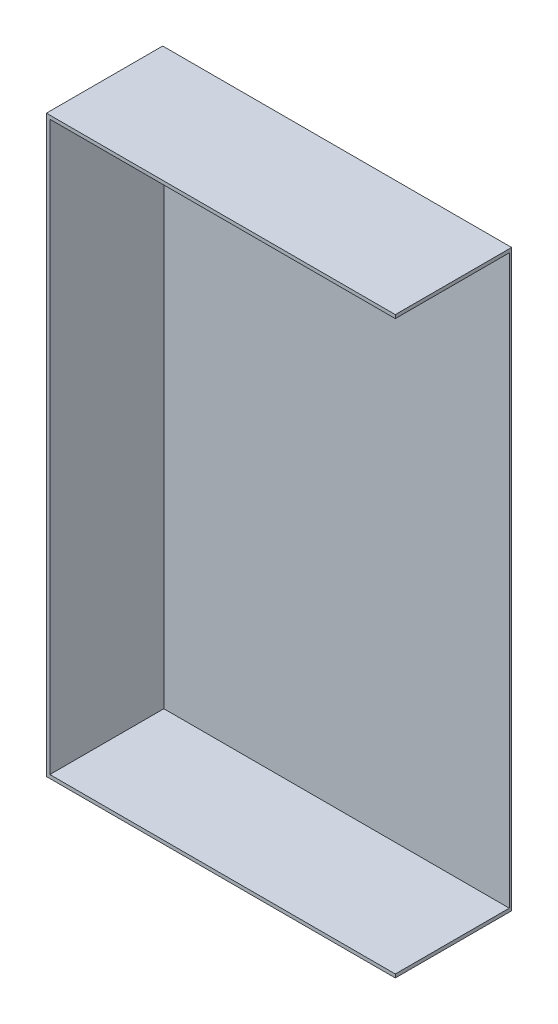
ISO-10303-21;
HEADER;
FILE_DESCRIPTION(('STEP AP214'),'2;1');
FILE_NAME('part.step','',(''),(''),'','','');
FILE_SCHEMA(('AUTOMOTIVE_DESIGN { 1 0 10303 214 1 1 1 1 }'));
ENDSEC;
DATA;
#1=APPLICATION_CONTEXT('core data for automotive mechanical design processes');
#2=APPLICATION_PROTOCOL_DEFINITION('international standard','automotive_design',2000,#1);
#3=PRODUCT_CONTEXT('',#1,'mechanical');
#4=PRODUCT('Part','Part','',(#3));
#5=PRODUCT_RELATED_PRODUCT_CATEGORY('part','',(#4));
#6=PRODUCT_DEFINITION_FORMATION('','',#4);
#7=PRODUCT_DEFINITION_CONTEXT('part definition',#1,'design');
#8=PRODUCT_DEFINITION('design','',#6,#7);
#9=PRODUCT_DEFINITION_SHAPE('','',#8);
#10=(LENGTH_UNIT() NAMED_UNIT(*) SI_UNIT(.MILLI.,.METRE.));
#11=(NAMED_UNIT(*) PLANE_ANGLE_UNIT() SI_UNIT($,.RADIAN.));
#12=(NAMED_UNIT(*) SI_UNIT($,.STERADIAN.) SOLID_ANGLE_UNIT());
#13=UNCERTAINTY_MEASURE_WITH_UNIT(LENGTH_MEASURE(1.E-05),#10,'distance_accuracy_value','');
#14=(GEOMETRIC_REPRESENTATION_CONTEXT(3) GLOBAL_UNCERTAINTY_ASSIGNED_CONTEXT((#13)) GLOBAL_UNIT_ASSIGNED_CONTEXT((#10,
#11,#12)) REPRESENTATION_CONTEXT('',''));
#15=CARTESIAN_POINT('',(0.,0.,0.));
#16=DIRECTION('',(0.,0.,1.));
#17=DIRECTION('',(1.,0.,0.));
#18=AXIS2_PLACEMENT_3D('',#15,#16,#17);
#19=CARTESIAN_POINT('',(0.,0.,127.));
#20=DIRECTION('',(1.,0.,0.));
#21=DIRECTION('',(0.,0.,-1.));
#22=AXIS2_PLACEMENT_3D('',#19,#20,#21);
#23=PLANE('',#22);
#24=DIRECTION('',(0.,-1.,0.));
#25=VECTOR('',#24,1.);
#26=CARTESIAN_POINT('',(0.,0.,0.));
#27=LINE('',#26,#25);
#28=CARTESIAN_POINT('',(0.,627.38,0.));
#29=VERTEX_POINT('',#28);
#30=CARTESIAN_POINT('',(0.,0.,0.));
#31=VERTEX_POINT('',#30);
#32=EDGE_CURVE('E149',#29,#31,#27,.T.);
#33=ORIENTED_EDGE('',*,*,#32,.T.);
#34=DIRECTION('',(0.,0.,-1.));
#35=VECTOR('',#34,1.);
#36=CARTESIAN_POINT('',(0.,0.,127.));
#37=LINE('',#36,#35);
#38=CARTESIAN_POINT('',(0.,0.,127.));
#39=VERTEX_POINT('',#38);
#40=EDGE_CURVE('E12',#39,#31,#37,.T.);
#41=ORIENTED_EDGE('',*,*,#40,.F.);
#42=DIRECTION('',(0.,-1.,0.));
#43=VECTOR('',#42,1.);
#44=CARTESIAN_POINT('',(0.,0.,127.));
#45=LINE('',#44,#43);
#46=CARTESIAN_POINT('',(0.,627.38,127.));
#47=VERTEX_POINT('',#46);
#48=EDGE_CURVE('E150',#47,#39,#45,.T.);
#49=ORIENTED_EDGE('',*,*,#48,.F.);
#50=DIRECTION('',(0.,0.,-1.));
#51=VECTOR('',#50,1.);
#52=CARTESIAN_POINT('',(0.,627.38,127.));
#53=LINE('',#52,#51);
#54=EDGE_CURVE('E158',#47,#29,#53,.T.);
#55=ORIENTED_EDGE('',*,*,#54,.T.);
#56=EDGE_LOOP('',(#33,#41,#49,#55));
#57=FACE_BOUND('',#56,.T.);
#58=ADVANCED_FACE('F41',(#57),#23,.F.);
#59=CARTESIAN_POINT('',(0.,0.,127.));
#60=DIRECTION('',(0.,1.,0.));
#61=DIRECTION('',(0.,0.,1.));
#62=AXIS2_PLACEMENT_3D('',#59,#60,#61);
#63=PLANE('',#62);
#64=DIRECTION('',(1.,0.,0.));
#65=VECTOR('',#64,1.);
#66=CARTESIAN_POINT('',(0.,0.,0.));
#67=LINE('',#66,#65);
#68=CARTESIAN_POINT('',(381.,0.,0.));
#69=VERTEX_POINT('',#68);
#70=EDGE_CURVE('E161',#31,#69,#67,.T.);
#71=ORIENTED_EDGE('',*,*,#70,.T.);
#72=DIRECTION('',(0.,0.,-1.));
#73=VECTOR('',#72,1.);
#74=CARTESIAN_POINT('',(381.,0.,127.));
#75=LINE('',#74,#73);
#76=CARTESIAN_POINT('',(381.,0.,127.));
#77=VERTEX_POINT('',#76);
#78=EDGE_CURVE('E48',#77,#69,#75,.T.);
#79=ORIENTED_EDGE('',*,*,#78,.F.);
#80=DIRECTION('',(1.,0.,0.));
#81=VECTOR('',#80,1.);
#82=CARTESIAN_POINT('',(0.,0.,127.));
#83=LINE('',#82,#81);
#84=EDGE_CURVE('E92',#39,#77,#83,.T.);
#85=ORIENTED_EDGE('',*,*,#84,.F.);
#86=ORIENTED_EDGE('',*,*,#40,.T.);
#87=EDGE_LOOP('',(#71,#79,#85,#86));
#88=FACE_BOUND('',#87,.T.);
#89=ADVANCED_FACE('F193',(#88),#63,.F.);
#90=CARTESIAN_POINT('',(381.,0.,127.));
#91=DIRECTION('',(-1.,0.,0.));
#92=DIRECTION('',(0.,0.,1.));
#93=AXIS2_PLACEMENT_3D('',#90,#91,#92);
#94=PLANE('',#93);
#95=DIRECTION('',(0.,1.,0.));
#96=VECTOR('',#95,1.);
#97=CARTESIAN_POINT('',(381.,0.,127.));
#98=LINE('',#97,#96);
#99=CARTESIAN_POINT('',(381.,623.57,127.));
#100=VERTEX_POINT('',#99);
#101=CARTESIAN_POINT('',(381.,627.38,127.));
#102=VERTEX_POINT('',#101);
#103=EDGE_CURVE('E153',#100,#102,#98,.T.);
#104=ORIENTED_EDGE('',*,*,#103,.F.);
#105=DIRECTION('',(0.,0.,1.));
#106=VECTOR('',#105,1.);
#107=CARTESIAN_POINT('',(381.,623.57,-725.516887260386));
#108=LINE('',#107,#106);
#109=CARTESIAN_POINT('',(381.,623.57,2.53999999999999));
#110=VERTEX_POINT('',#109);
#111=EDGE_CURVE('E141',#110,#100,#108,.T.);
#112=ORIENTED_EDGE('',*,*,#111,.F.);
#113=DIRECTION('',(0.,1.,0.));
#114=VECTOR('',#113,1.);
#115=CARTESIAN_POINT('',(381.,623.57,2.53999999999999));
#116=LINE('',#115,#114);
#117=CARTESIAN_POINT('',(381.,3.81000000000002,2.53999999999999));
#118=VERTEX_POINT('',#117);
#119=EDGE_CURVE('E132',#118,#110,#116,.T.);
#120=ORIENTED_EDGE('',*,*,#119,.F.);
#121=DIRECTION('',(0.,0.,1.));
#122=VECTOR('',#121,1.);
#123=CARTESIAN_POINT('',(381.,3.81000000000002,-725.516887260386));
#124=LINE('',#123,#122);
#125=CARTESIAN_POINT('',(381.,3.81000000000002,127.));
#126=VERTEX_POINT('',#125);
#127=EDGE_CURVE('E142',#118,#126,#124,.T.);
#128=ORIENTED_EDGE('',*,*,#127,.T.);
#129=EDGE_CURVE('E154',#77,#126,#98,.T.);
#130=ORIENTED_EDGE('',*,*,#129,.F.);
#131=ORIENTED_EDGE('',*,*,#78,.T.);
#132=DIRECTION('',(0.,1.,0.));
#133=VECTOR('',#132,1.);
#134=CARTESIAN_POINT('',(381.,0.,0.));
#135=LINE('',#134,#133);
#136=CARTESIAN_POINT('',(381.,627.38,0.));
#137=VERTEX_POINT('',#136);
#138=EDGE_CURVE('E163',#69,#137,#135,.T.);
#139=ORIENTED_EDGE('',*,*,#138,.T.);
#140=DIRECTION('',(0.,0.,-1.));
#141=VECTOR('',#140,1.);
#142=CARTESIAN_POINT('',(381.,627.38,127.));
#143=LINE('',#142,#141);
#144=EDGE_CURVE('E167',#102,#137,#143,.T.);
#145=ORIENTED_EDGE('',*,*,#144,.F.);
#146=EDGE_LOOP('',(#104,#112,#120,#128,#130,#131,#139,#145));
#147=FACE_BOUND('',#146,.T.);
#148=ADVANCED_FACE('F173',(#147),#94,.F.);
#149=CARTESIAN_POINT('',(0.,627.38,127.));
#150=DIRECTION('',(0.,-1.,0.));
#151=DIRECTION('',(0.,0.,-1.));
#152=AXIS2_PLACEMENT_3D('',#149,#150,#151);
#153=PLANE('',#152);
#154=DIRECTION('',(-1.,0.,0.));
#155=VECTOR('',#154,1.);
#156=CARTESIAN_POINT('',(0.,627.38,0.));
#157=LINE('',#156,#155);
#158=EDGE_CURVE('E85',#137,#29,#157,.T.);
#159=ORIENTED_EDGE('',*,*,#158,.T.);
#160=ORIENTED_EDGE('',*,*,#54,.F.);
#161=DIRECTION('',(-1.,0.,0.));
#162=VECTOR('',#161,1.);
#163=CARTESIAN_POINT('',(0.,627.38,127.));
#164=LINE('',#163,#162);
#165=EDGE_CURVE('E64',#102,#47,#164,.T.);
#166=ORIENTED_EDGE('',*,*,#165,.F.);
#167=ORIENTED_EDGE('',*,*,#144,.T.);
#168=EDGE_LOOP('',(#159,#160,#166,#167));
#169=FACE_BOUND('',#168,.T.);
#170=ADVANCED_FACE('F181',(#169),#153,.F.);
#171=CARTESIAN_POINT('',(0.,0.,127.));
#172=DIRECTION('',(0.,0.,-1.));
#173=DIRECTION('',(-1.,0.,0.));
#174=AXIS2_PLACEMENT_3D('',#171,#172,#173);
#175=PLANE('',#174);
#176=DIRECTION('',(0.,-1.,0.));
#177=VECTOR('',#176,1.);
#178=CARTESIAN_POINT('',(3.80999999999998,623.57,127.));
#179=LINE('',#178,#177);
#180=CARTESIAN_POINT('',(3.80999999999998,623.57,127.));
#181=VERTEX_POINT('',#180);
#182=CARTESIAN_POINT('',(3.81000000000001,3.80999999999999,127.));
#183=VERTEX_POINT('',#182);
#184=EDGE_CURVE('E55',#181,#183,#179,.T.);
#185=ORIENTED_EDGE('',*,*,#184,.F.);
#186=DIRECTION('',(-1.,0.,0.));
#187=VECTOR('',#186,1.);
#188=CARTESIAN_POINT('',(381.,623.57,127.));
#189=LINE('',#188,#187);
#190=EDGE_CURVE('E128',#100,#181,#189,.T.);
#191=ORIENTED_EDGE('',*,*,#190,.F.);
#192=ORIENTED_EDGE('',*,*,#103,.T.);
#193=ORIENTED_EDGE('',*,*,#165,.T.);
#194=ORIENTED_EDGE('',*,*,#48,.T.);
#195=ORIENTED_EDGE('',*,*,#84,.T.);
#196=ORIENTED_EDGE('',*,*,#129,.T.);
#197=DIRECTION('',(1.,0.,0.));
#198=VECTOR('',#197,1.);
#199=CARTESIAN_POINT('',(381.,3.81000000000002,127.));
#200=LINE('',#199,#198);
#201=EDGE_CURVE('E134',#183,#126,#200,.T.);
#202=ORIENTED_EDGE('',*,*,#201,.F.);
#203=EDGE_LOOP('',(#185,#191,#192,#193,#194,#195,#196,#202));
#204=FACE_BOUND('',#203,.T.);
#205=ADVANCED_FACE('F182',(#204),#175,.F.);
#206=CARTESIAN_POINT('',(0.,0.,0.));
#207=DIRECTION('',(0.,0.,-1.));
#208=DIRECTION('',(-1.,0.,0.));
#209=AXIS2_PLACEMENT_3D('',#206,#207,#208);
#210=PLANE('',#209);
#211=ORIENTED_EDGE('',*,*,#32,.F.);
#212=ORIENTED_EDGE('',*,*,#158,.F.);
#213=ORIENTED_EDGE('',*,*,#138,.F.);
#214=ORIENTED_EDGE('',*,*,#70,.F.);
#215=EDGE_LOOP('',(#211,#212,#213,#214));
#216=FACE_BOUND('',#215,.T.);
#217=ADVANCED_FACE('F177',(#216),#210,.T.);
#218=CARTESIAN_POINT('',(0.,0.,2.54));
#219=DIRECTION('',(0.,0.,-1.));
#220=DIRECTION('',(-1.,0.,0.));
#221=AXIS2_PLACEMENT_3D('',#218,#219,#220);
#222=PLANE('',#221);
#223=ORIENTED_EDGE('',*,*,#119,.T.);
#224=DIRECTION('',(-1.,0.,0.));
#225=VECTOR('',#224,1.);
#226=CARTESIAN_POINT('',(381.,623.57,2.53999999999999));
#227=LINE('',#226,#225);
#228=CARTESIAN_POINT('',(3.80999999999998,623.57,2.53999999999999));
#229=VERTEX_POINT('',#228);
#230=EDGE_CURVE('E125',#110,#229,#227,.T.);
#231=ORIENTED_EDGE('',*,*,#230,.T.);
#232=DIRECTION('',(0.,-1.,0.));
#233=VECTOR('',#232,1.);
#234=CARTESIAN_POINT('',(3.80999999999998,623.57,2.53999999999999));
#235=LINE('',#234,#233);
#236=CARTESIAN_POINT('',(3.81000000000001,3.80999999999998,2.53999999999999));
#237=VERTEX_POINT('',#236);
#238=EDGE_CURVE('E113',#229,#237,#235,.T.);
#239=ORIENTED_EDGE('',*,*,#238,.T.);
#240=DIRECTION('',(1.,0.,0.));
#241=VECTOR('',#240,1.);
#242=CARTESIAN_POINT('',(381.,3.81000000000002,2.53999999999999));
#243=LINE('',#242,#241);
#244=EDGE_CURVE('E143',#237,#118,#243,.T.);
#245=ORIENTED_EDGE('',*,*,#244,.T.);
#246=EDGE_LOOP('',(#223,#231,#239,#245));
#247=FACE_BOUND('',#246,.T.);
#248=ADVANCED_FACE('F130',(#247),#222,.F.);
#249=CARTESIAN_POINT('',(381.,623.57,-725.516887260386));
#250=DIRECTION('',(0.,1.,0.));
#251=DIRECTION('',(0.,0.,1.));
#252=AXIS2_PLACEMENT_3D('',#249,#250,#251);
#253=PLANE('',#252);
#254=ORIENTED_EDGE('',*,*,#111,.T.);
#255=ORIENTED_EDGE('',*,*,#190,.T.);
#256=DIRECTION('',(0.,0.,1.));
#257=VECTOR('',#256,1.);
#258=CARTESIAN_POINT('',(3.80999999999998,623.57,-725.516887260386));
#259=LINE('',#258,#257);
#260=EDGE_CURVE('E116',#229,#181,#259,.T.);
#261=ORIENTED_EDGE('',*,*,#260,.F.);
#262=ORIENTED_EDGE('',*,*,#230,.F.);
#263=EDGE_LOOP('',(#254,#255,#261,#262));
#264=FACE_BOUND('',#263,.T.);
#265=ADVANCED_FACE('F124',(#264),#253,.F.);
#266=CARTESIAN_POINT('',(3.80999999999998,623.57,-725.516887260386));
#267=DIRECTION('',(-1.,0.,0.));
#268=DIRECTION('',(0.,-1.,0.));
#269=AXIS2_PLACEMENT_3D('',#266,#267,#268);
#270=PLANE('',#269);
#271=ORIENTED_EDGE('',*,*,#260,.T.);
#272=ORIENTED_EDGE('',*,*,#184,.T.);
#273=DIRECTION('',(0.,0.,1.));
#274=VECTOR('',#273,1.);
#275=CARTESIAN_POINT('',(3.81000000000001,3.80999999999999,-725.516887260386));
#276=LINE('',#275,#274);
#277=EDGE_CURVE('E118',#237,#183,#276,.T.);
#278=ORIENTED_EDGE('',*,*,#277,.F.);
#279=ORIENTED_EDGE('',*,*,#238,.F.);
#280=EDGE_LOOP('',(#271,#272,#278,#279));
#281=FACE_BOUND('',#280,.T.);
#282=ADVANCED_FACE('F115',(#281),#270,.F.);
#283=CARTESIAN_POINT('',(381.,3.81000000000002,-725.516887260386));
#284=DIRECTION('',(0.,-1.,0.));
#285=DIRECTION('',(1.,0.,0.));
#286=AXIS2_PLACEMENT_3D('',#283,#284,#285);
#287=PLANE('',#286);
#288=ORIENTED_EDGE('',*,*,#277,.T.);
#289=ORIENTED_EDGE('',*,*,#201,.T.);
#290=ORIENTED_EDGE('',*,*,#127,.F.);
#291=ORIENTED_EDGE('',*,*,#244,.F.);
#292=EDGE_LOOP('',(#288,#289,#290,#291));
#293=FACE_BOUND('',#292,.T.);
#294=ADVANCED_FACE('F185',(#293),#287,.F.);
#295=CLOSED_SHELL('',(#58,#89,#148,#170,#205,#217,#248,#265,#282,#294));
#296=MANIFOLD_SOLID_BREP('B2',#295);
#297=ADVANCED_BREP_SHAPE_REPRESENTATION('',(#18,#296),#14);
#298=SHAPE_DEFINITION_REPRESENTATION(#9,#297);
ENDSEC;
END-ISO-10303-21;
